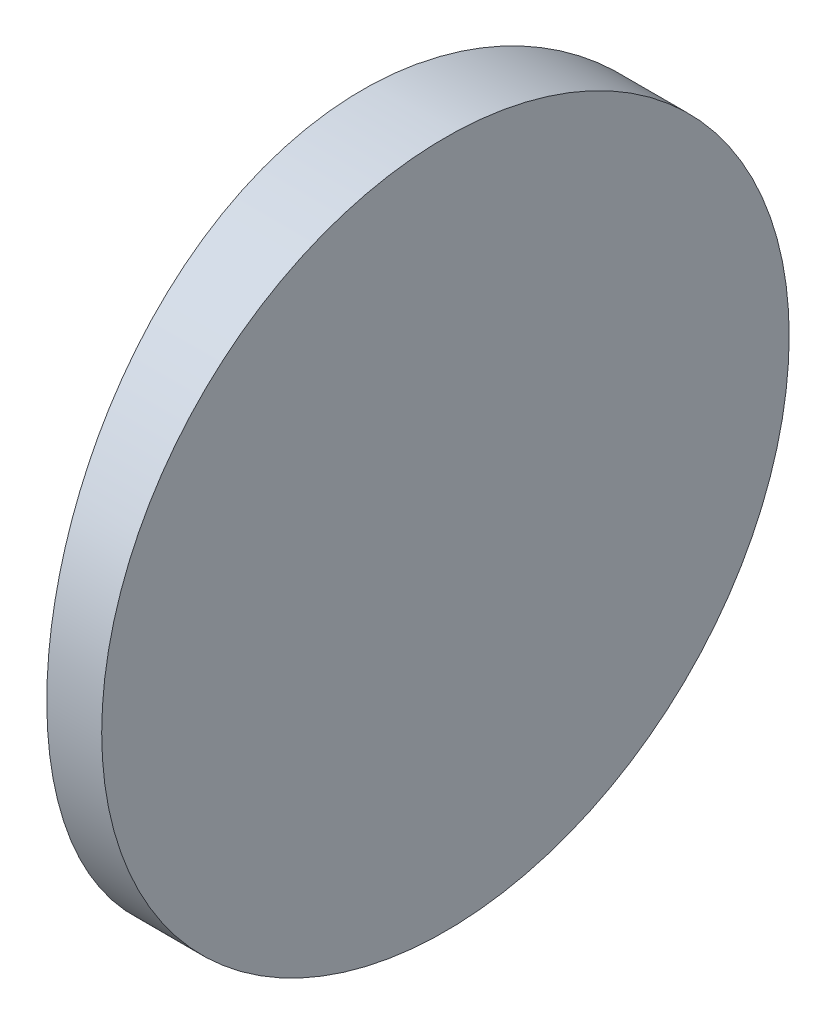
ISO-10303-21;
HEADER;
FILE_DESCRIPTION(('STEP AP214'),'2;1');
FILE_NAME('part.step','',(''),(''),'','','');
FILE_SCHEMA(('AUTOMOTIVE_DESIGN { 1 0 10303 214 1 1 1 1 }'));
ENDSEC;
DATA;
#1=APPLICATION_CONTEXT('core data for automotive mechanical design processes');
#2=APPLICATION_PROTOCOL_DEFINITION('international standard','automotive_design',2000,#1);
#3=PRODUCT_CONTEXT('',#1,'mechanical');
#4=PRODUCT('Part','Part','',(#3));
#5=PRODUCT_RELATED_PRODUCT_CATEGORY('part','',(#4));
#6=PRODUCT_DEFINITION_FORMATION('','',#4);
#7=PRODUCT_DEFINITION_CONTEXT('part definition',#1,'design');
#8=PRODUCT_DEFINITION('design','',#6,#7);
#9=PRODUCT_DEFINITION_SHAPE('','',#8);
#10=(LENGTH_UNIT() NAMED_UNIT(*) SI_UNIT(.MILLI.,.METRE.));
#11=(NAMED_UNIT(*) PLANE_ANGLE_UNIT() SI_UNIT($,.RADIAN.));
#12=(NAMED_UNIT(*) SI_UNIT($,.STERADIAN.) SOLID_ANGLE_UNIT());
#13=UNCERTAINTY_MEASURE_WITH_UNIT(LENGTH_MEASURE(1.E-05),#10,'distance_accuracy_value','');
#14=(GEOMETRIC_REPRESENTATION_CONTEXT(3) GLOBAL_UNCERTAINTY_ASSIGNED_CONTEXT((#13)) GLOBAL_UNIT_ASSIGNED_CONTEXT((#10,
#11,#12)) REPRESENTATION_CONTEXT('',''));
#15=CARTESIAN_POINT('',(0.,0.,0.));
#16=DIRECTION('',(0.,0.,1.));
#17=DIRECTION('',(1.,0.,0.));
#18=AXIS2_PLACEMENT_3D('',#15,#16,#17);
#19=CARTESIAN_POINT('',(4.35520433485127,25.,0.));
#20=DIRECTION('',(0.,-1.,0.));
#21=DIRECTION('',(0.,0.,-1.));
#22=AXIS2_PLACEMENT_3D('',#19,#20,#21);
#23=CYLINDRICAL_SURFACE('',#22,77.55);
#24=CARTESIAN_POINT('',(-73.1947956651487,0.,0.));
#25=CARTESIAN_POINT('',(-73.1947973921539,-4.10317721086677E-06,-0.348732418167084));
#26=CARTESIAN_POINT('',(-73.19243874566,0.0145991869223439,-0.697405724360002));
#27=CARTESIAN_POINT('',(-73.1830735480049,0.0728963007923504,-1.39235955210936));
#28=CARTESIAN_POINT('',(-73.1760659405696,0.116596735632196,-1.7386395118114));
#29=CARTESIAN_POINT('',(-73.1575880475862,0.232817768373885,-2.42652973377259));
#30=CARTESIAN_POINT('',(-73.1461136164522,0.305365139990195,-2.76813535209596));
#31=CARTESIAN_POINT('',(-73.1190249431766,0.478726059624053,-3.44393040507212));
#32=CARTESIAN_POINT('',(-73.1034106899046,0.579539683638897,-3.77811981978294));
#33=CARTESIAN_POINT('',(-73.0684935534954,0.80858082020495,-4.43644935575857));
#34=CARTESIAN_POINT('',(-73.0491937948171,0.936785122635564,-4.76059772091078));
#35=CARTESIAN_POINT('',(-73.0074332389318,1.21971820035515,-5.39689505868345));
#36=CARTESIAN_POINT('',(-72.9849724001944,1.37444732413546,-5.70904387358413));
#37=CARTESIAN_POINT('',(-72.9375161388734,1.70928248346709,-6.3191355754508));
#38=CARTESIAN_POINT('',(-72.9125212162651,1.88938351585668,-6.61708124771072));
#39=CARTESIAN_POINT('',(-72.8606823623338,2.27371524420478,-7.19680838255119));
#40=CARTESIAN_POINT('',(-72.8338384260767,2.47794600455274,-7.47858980199495));
#41=CARTESIAN_POINT('',(-72.7788225475744,2.91083713416932,-8.02625398405843));
#42=CARTESIAN_POINT('',(-72.7506417489,3.13967870248134,-8.29199264739339));
#43=CARTESIAN_POINT('',(-72.6939403029556,3.61885303527558,-8.80329429484927));
#44=CARTESIAN_POINT('',(-72.665419652533,3.86918599925756,-9.04885709164076));
#45=CARTESIAN_POINT('',(-72.6088302882738,4.38969434462651,-9.5181812470075));
#46=CARTESIAN_POINT('',(-72.5807617045525,4.65987531854917,-9.74193641924889));
#47=CARTESIAN_POINT('',(-72.5258761430286,5.21816054649993,-10.1660067367192));
#48=CARTESIAN_POINT('',(-72.4990591499087,5.50626458107872,-10.3663221688569));
#49=CARTESIAN_POINT('',(-72.4472772017461,6.10025590043232,-10.743265961694));
#50=CARTESIAN_POINT('',(-72.4223247360216,6.40624220939971,-10.919740051913));
#51=CARTESIAN_POINT('',(-72.375179248661,7.03221604742968,-11.2462418239459));
#52=CARTESIAN_POINT('',(-72.3529862210295,7.35220354606988,-11.3962695632201));
#53=CARTESIAN_POINT('',(-72.3120283678728,8.0036033851478,-11.6686288803699));
#54=CARTESIAN_POINT('',(-72.2932601494394,8.33500402746095,-11.7909878983117));
#55=CARTESIAN_POINT('',(-72.2596805324741,9.00704230095548,-12.0072419843926));
#56=CARTESIAN_POINT('',(-72.2448681715481,9.34767766323002,-12.1011439764012));
#57=CARTESIAN_POINT('',(-72.2153970079807,10.1515496923076,-12.286465749466));
#58=CARTESIAN_POINT('',(-72.2024612566872,10.6175324460711,-12.3664555428008));
#59=CARTESIAN_POINT('',(-72.1851396670351,11.5557129714189,-12.4732195462682));
#60=CARTESIAN_POINT('',(-72.1807537193394,12.0279106634473,-12.4999944369267));
#61=CARTESIAN_POINT('',(-72.1807494568944,12.8486993424831,-12.5000041090528));
#62=CARTESIAN_POINT('',(-72.18313916871,13.1973395690073,-12.4854035619149));
#63=CARTESIAN_POINT('',(-72.1926249066719,13.8922263406357,-12.4271176732916));
#64=CARTESIAN_POINT('',(-72.1997220030424,14.2384723233167,-12.3834257178637));
#65=CARTESIAN_POINT('',(-72.2184273319643,14.9262937894786,-12.2672278914281));
#66=CARTESIAN_POINT('',(-72.2300397624108,15.2678646196737,-12.1946952058406));
#67=CARTESIAN_POINT('',(-72.2574371965853,15.9435894025058,-12.0213705136426));
#68=CARTESIAN_POINT('',(-72.2732222129662,16.2777433326483,-11.9205784213379));
#69=CARTESIAN_POINT('',(-72.3084939520586,16.9359973740148,-11.6915892827833));
#70=CARTESIAN_POINT('',(-72.3279774795294,17.2601058846333,-11.5634158800687));
#71=CARTESIAN_POINT('',(-72.3700983851355,17.8963269108159,-11.2805520955603));
#72=CARTESIAN_POINT('',(-72.392735804722,18.2084392686472,-11.1258613652462));
#73=CARTESIAN_POINT('',(-72.4405184182261,18.8184645039228,-10.7911089009562));
#74=CARTESIAN_POINT('',(-72.4656631210608,19.1163801451451,-10.6110521323971));
#75=CARTESIAN_POINT('',(-72.5177581993117,19.6960554480763,-10.2268129929731));
#76=CARTESIAN_POINT('',(-72.5447085797919,19.9778150644722,-10.0226305544474));
#77=CARTESIAN_POINT('',(-72.5998893154847,20.525508782047,-9.5897879035087));
#78=CARTESIAN_POINT('',(-72.6281283358892,20.7912946183784,-9.36094116773512));
#79=CARTESIAN_POINT('',(-72.684884417115,21.3026910712124,-8.88174649730203));
#80=CARTESIAN_POINT('',(-72.713401480546,21.548301498148,-8.63139836066164));
#81=CARTESIAN_POINT('',(-72.7699222566136,22.0177189027485,-8.11085018851573));
#82=CARTESIAN_POINT('',(-72.7979258233857,22.2415197607321,-7.84064461818485));
#83=CARTESIAN_POINT('',(-72.8526272824015,22.6656779389138,-7.28230085375329));
#84=CARTESIAN_POINT('',(-72.8793251908941,22.8660355509089,-6.99416288292478));
#85=CARTESIAN_POINT('',(-72.9308231338419,23.2430273209818,-6.40014445568977));
#86=CARTESIAN_POINT('',(-72.9556107641236,23.4195112682373,-6.09416755826361));
#87=CARTESIAN_POINT('',(-73.0024045774418,23.7460337537623,-5.46821168987096));
#88=CARTESIAN_POINT('',(-73.0244107663116,23.8960723474928,-5.14823274827121));
#89=CARTESIAN_POINT('',(-73.0649944419756,24.1684540216642,-4.49685011953017));
#90=CARTESIAN_POINT('',(-73.0835753142781,24.2908244760899,-4.1654581016059));
#91=CARTESIAN_POINT('',(-73.116800970003,24.5071018006331,-3.49343900658129));
#92=CARTESIAN_POINT('',(-73.1314467091925,24.6010155830313,-3.15281419411331));
#93=CARTESIAN_POINT('',(-73.1605791294902,24.7863889563178,-2.34887019783742));
#94=CARTESIAN_POINT('',(-73.1733568250548,24.8664077033677,-1.88280315765083));
#95=CARTESIAN_POINT('',(-73.1904638721423,24.9732101223681,-0.94445457231252));
#96=CARTESIAN_POINT('',(-73.1947933268361,24.9999944444227,-0.472173103122919));
#97=CARTESIAN_POINT('',(-73.1947973921539,25.0000041031772,0.348732418167164));
#98=CARTESIAN_POINT('',(-73.19243874566,24.9854008130777,0.69740572436008));
#99=CARTESIAN_POINT('',(-73.1830735480049,24.9271036992076,1.39235955210943));
#100=CARTESIAN_POINT('',(-73.1760659405696,24.8834032643678,1.73863951181148));
#101=CARTESIAN_POINT('',(-73.1575880475862,24.7671822316261,2.42652973377267));
#102=CARTESIAN_POINT('',(-73.1461136164522,24.6946348600098,2.76813535209604));
#103=CARTESIAN_POINT('',(-73.1190249431766,24.5212739403759,3.44393040507221));
#104=CARTESIAN_POINT('',(-73.1034106899046,24.4204603163611,3.77811981978302));
#105=CARTESIAN_POINT('',(-73.0684935534954,24.1914191797951,4.43644935575865));
#106=CARTESIAN_POINT('',(-73.0491937948171,24.0632148773644,4.76059772091086));
#107=CARTESIAN_POINT('',(-73.0074332389318,23.7802817996448,5.39689505868353));
#108=CARTESIAN_POINT('',(-72.9849724001944,23.6255526758645,5.70904387358421));
#109=CARTESIAN_POINT('',(-72.9375161388734,23.2907175165329,6.31913557545088));
#110=CARTESIAN_POINT('',(-72.9125212162651,23.1106164841433,6.6170812477108));
#111=CARTESIAN_POINT('',(-72.8606823623338,22.7262847557952,7.19680838255127));
#112=CARTESIAN_POINT('',(-72.8338384260767,22.5220539954473,7.47858980199503));
#113=CARTESIAN_POINT('',(-72.7788225475744,22.0891628658307,8.0262539840585));
#114=CARTESIAN_POINT('',(-72.7506417489,21.8603212975187,8.29199264739347));
#115=CARTESIAN_POINT('',(-72.6939403029556,21.3811469647244,8.80329429484934));
#116=CARTESIAN_POINT('',(-72.665419652533,21.1308140007424,9.04885709164084));
#117=CARTESIAN_POINT('',(-72.6088302882738,20.6103056553735,9.51818124700757));
#118=CARTESIAN_POINT('',(-72.5807617045525,20.3401246814508,9.74193641924897));
#119=CARTESIAN_POINT('',(-72.5258761430286,19.7818394535001,10.1660067367193));
#120=CARTESIAN_POINT('',(-72.4990591499087,19.4937354189213,10.366322168857));
#121=CARTESIAN_POINT('',(-72.4472772017461,18.8997440995677,10.7432659616941));
#122=CARTESIAN_POINT('',(-72.4223247360216,18.5937577906003,10.9197400519131));
#123=CARTESIAN_POINT('',(-72.3751792486609,17.9677839525703,11.246241823946));
#124=CARTESIAN_POINT('',(-72.3529862210294,17.6477964539301,11.3962695632201));
#125=CARTESIAN_POINT('',(-72.3120283678727,16.9963966148522,11.66862888037));
#126=CARTESIAN_POINT('',(-72.2932601494394,16.664995972539,11.7909878983118));
#127=CARTESIAN_POINT('',(-72.2596805324741,15.9929576990445,12.0072419843926));
#128=CARTESIAN_POINT('',(-72.2448681715481,15.65232233677,12.1011439764013));
#129=CARTESIAN_POINT('',(-72.2153970079807,14.8484503076924,12.286465749466));
#130=CARTESIAN_POINT('',(-72.2024612566872,14.3824675539289,12.3664555428008));
#131=CARTESIAN_POINT('',(-72.1851396670351,13.4442870285811,12.4732195462682));
#132=CARTESIAN_POINT('',(-72.1807537193394,12.9720893365527,12.4999944369267));
#133=CARTESIAN_POINT('',(-72.1807494568944,12.1513006575169,12.5000041090528));
#134=CARTESIAN_POINT('',(-72.18313916871,11.8026604309927,12.485403561915));
#135=CARTESIAN_POINT('',(-72.1926249066718,11.1077736593643,12.4271176732917));
#136=CARTESIAN_POINT('',(-72.1997220030424,10.7615276766833,12.3834257178638));
#137=CARTESIAN_POINT('',(-72.2184273319643,10.0737062105214,12.2672278914282));
#138=CARTESIAN_POINT('',(-72.2300397624108,9.73213538032631,12.1946952058407));
#139=CARTESIAN_POINT('',(-72.2574371965853,9.05641059749424,12.0213705136426));
#140=CARTESIAN_POINT('',(-72.2732222129662,8.72225666735167,11.920578421338));
#141=CARTESIAN_POINT('',(-72.3084939520586,8.06400262598524,11.6915892827834));
#142=CARTESIAN_POINT('',(-72.3279774795294,7.73989411536671,11.5634158800688));
#143=CARTESIAN_POINT('',(-72.3700983851355,7.10367308918409,11.2805520955604));
#144=CARTESIAN_POINT('',(-72.3927358047219,6.79156073135283,11.1258613652463));
#145=CARTESIAN_POINT('',(-72.4405184182261,6.18153549607718,10.7911089009563));
#146=CARTESIAN_POINT('',(-72.4656631210608,5.88361985485495,10.6110521323972));
#147=CARTESIAN_POINT('',(-72.5177581993117,5.30394455192372,10.2268129929732));
#148=CARTESIAN_POINT('',(-72.5447085797919,5.02218493552779,10.0226305544475));
#149=CARTESIAN_POINT('',(-72.5998893154847,4.474491217953,9.58978790350879));
#150=CARTESIAN_POINT('',(-72.6281283358891,4.20870538162166,9.36094116773521));
#151=CARTESIAN_POINT('',(-72.6848844171149,3.69730892878758,8.88174649730212));
#152=CARTESIAN_POINT('',(-72.7134014805459,3.45169850185198,8.63139836066172));
#153=CARTESIAN_POINT('',(-72.7699222566135,2.98228109725148,8.11085018851581));
#154=CARTESIAN_POINT('',(-72.7979258233857,2.75848023926792,7.84064461818493));
#155=CARTESIAN_POINT('',(-72.8526272824015,2.33432206108622,7.28230085375337));
#156=CARTESIAN_POINT('',(-72.8793251908941,2.13396444909109,6.99416288292486));
#157=CARTESIAN_POINT('',(-72.9308231338419,1.75697267901818,6.40014445568985));
#158=CARTESIAN_POINT('',(-72.9556107641236,1.58048873176268,6.09416755826369));
#159=CARTESIAN_POINT('',(-73.0024045774418,1.25396624623769,5.46821168987104));
#160=CARTESIAN_POINT('',(-73.0244107663116,1.10392765250721,5.14823274827129));
#161=CARTESIAN_POINT('',(-73.0649944419756,0.831545978335843,4.49685011953025));
#162=CARTESIAN_POINT('',(-73.0835753142781,0.709175523910129,4.16545810160598));
#163=CARTESIAN_POINT('',(-73.116800970003,0.492898199366868,3.49343900658138));
#164=CARTESIAN_POINT('',(-73.1314467091925,0.398984416968705,3.15281419411339));
#165=CARTESIAN_POINT('',(-73.1605791294902,0.213611043682181,2.3488701978375));
#166=CARTESIAN_POINT('',(-73.1733568250548,0.133592296632291,1.88280315765091));
#167=CARTESIAN_POINT('',(-73.1904638721423,0.0267898776318925,0.944454572312601));
#168=CARTESIAN_POINT('',(-73.1947933268361,5.55557731692655E-06,0.472173103123));
#169=CARTESIAN_POINT('',(-73.1947956651487,0.,0.));
#170=B_SPLINE_CURVE_WITH_KNOTS('',3,(#24,#25,#26,#27,#28,#29,#30,#31,#32,#33,#34,#35,#36,#37,
#38,#39,#40,#41,#42,#43,#44,#45,#46,#47,#48,#49,#50,#51,#52,#53,#54,#55,#56,#57,#58,#59,#60,#61,
#62,#63,#64,#65,#66,#67,#68,#69,#70,#71,#72,#73,#74,#75,#76,#77,#78,#79,#80,#81,#82,#83,#84,#85,
#86,#87,#88,#89,#90,#91,#92,#93,#94,#95,#96,#97,#98,#99,#100,#101,#102,#103,#104,#105,#106,#107,
#108,#109,#110,#111,#112,#113,#114,#115,#116,#117,#118,#119,#120,#121,#122,#123,#124,#125,#126,
#127,#128,#129,#130,#131,#132,#133,#134,#135,#136,#137,#138,#139,#140,#141,#142,#143,#144,#145,
#146,#147,#148,#149,#150,#151,#152,#153,#154,#155,#156,#157,#158,#159,#160,#161,#162,#163,#164,
#165,#166,#167,#168,#169),.UNSPECIFIED.,.T.,.F.,(4,2,2,2,2,2,2,2,2,2,2,2,2,2,2,2,2,2,2,2,2,2,2,
2,2,2,2,2,2,2,2,2,2,2,2,2,2,2,2,2,2,2,2,2,2,2,2,2,2,2,2,2,2,2,2,2,2,2,2,2,2,2,2,2,2,2,2,2,2,2,2,
2,4),(0.,1.04578216686204,2.0918020236706,3.13879499776258,4.18579078685094,5.23190287408731,
6.27802870652249,7.32394853831524,8.36987116117629,9.42410351406446,10.4783456542113,
11.5328859940039,12.5874134245828,13.6484672596895,14.7095187894081,15.7695133755096,
16.8292498472286,18.2449738300809,19.6606797081731,20.7063625283888,21.7522831661971,
22.7991785278635,23.8460770641799,24.8920752400737,25.9380871646969,26.9838946156532,
28.0297049996597,29.0840680102368,30.1384409264232,31.1931088488415,32.2477636424603,
33.3087728888123,34.3697799099973,35.4297325656219,36.4894275461935,37.9054021316331,
39.3213594249446,40.3671415918066,41.4131614486152,42.4601544227072,43.5071502117955,
44.5532622990319,45.5993881314671,46.6453079632598,47.6912305861209,48.7454629390091,
49.7997050791559,50.8542454189485,51.9087728495274,52.9698266846341,54.0308782143527,
55.0908728004542,56.1506092721732,57.5663332550254,58.9820391331177,60.0277219533334,
61.0736425911417,62.120537952808,63.1674364891245,64.2134346650183,65.2594465896415,
66.3052540405978,67.3510644246043,68.4054274351814,69.4598003513677,70.5144682737861,
71.5691230674049,72.6301323137569,73.6911393349419,74.7510919905665,75.8107869711381,
77.2267615565777,78.6427188498892),.UNSPECIFIED.);
#171=CARTESIAN_POINT('',(-73.1947956651487,0.,0.));
#172=VERTEX_POINT('',#171);
#173=EDGE_CURVE('E11',#172,#172,#170,.T.);
#174=ORIENTED_EDGE('',*,*,#173,.F.);
#175=EDGE_LOOP('',(#174));
#176=FACE_BOUND('',#175,.T.);
#177=ADVANCED_FACE('F71',(#176),#23,.T.);
#178=CARTESIAN_POINT('',(-70.1847956651488,25.,-12.5));
#179=DIRECTION('',(1.,0.,0.));
#180=DIRECTION('',(0.,0.,-1.));
#181=AXIS2_PLACEMENT_3D('',#178,#179,#180);
#182=PLANE('',#181);
#183=CARTESIAN_POINT('',(-70.1847956651488,12.5,0.));
#184=DIRECTION('',(1.,0.,0.));
#185=DIRECTION('',(0.,0.,-1.));
#186=AXIS2_PLACEMENT_3D('',#183,#184,#185);
#187=CIRCLE('',#186,12.5);
#188=CARTESIAN_POINT('',(-70.1847956651488,12.5,-12.5));
#189=VERTEX_POINT('',#188);
#190=EDGE_CURVE('E81',#189,#189,#187,.T.);
#191=ORIENTED_EDGE('',*,*,#190,.T.);
#192=EDGE_LOOP('',(#191));
#193=FACE_BOUND('',#192,.T.);
#194=ADVANCED_FACE('F73',(#193),#182,.T.);
#195=CARTESIAN_POINT('',(-82.8847956651488,12.5,0.));
#196=DIRECTION('',(1.,0.,0.));
#197=DIRECTION('',(0.,0.,-1.));
#198=AXIS2_PLACEMENT_3D('',#195,#196,#197);
#199=CYLINDRICAL_SURFACE('',#198,12.5);
#200=ORIENTED_EDGE('',*,*,#190,.F.);
#201=EDGE_LOOP('',(#200));
#202=FACE_BOUND('',#201,.T.);
#203=ORIENTED_EDGE('',*,*,#173,.T.);
#204=EDGE_LOOP('',(#203));
#205=FACE_BOUND('',#204,.T.);
#206=ADVANCED_FACE('F88',(#202,#205),#199,.T.);
#207=CLOSED_SHELL('',(#177,#194,#206));
#208=MANIFOLD_SOLID_BREP('B2',#207);
#209=ADVANCED_BREP_SHAPE_REPRESENTATION('',(#18,#208),#14);
#210=SHAPE_DEFINITION_REPRESENTATION(#9,#209);
ENDSEC;
END-ISO-10303-21;
